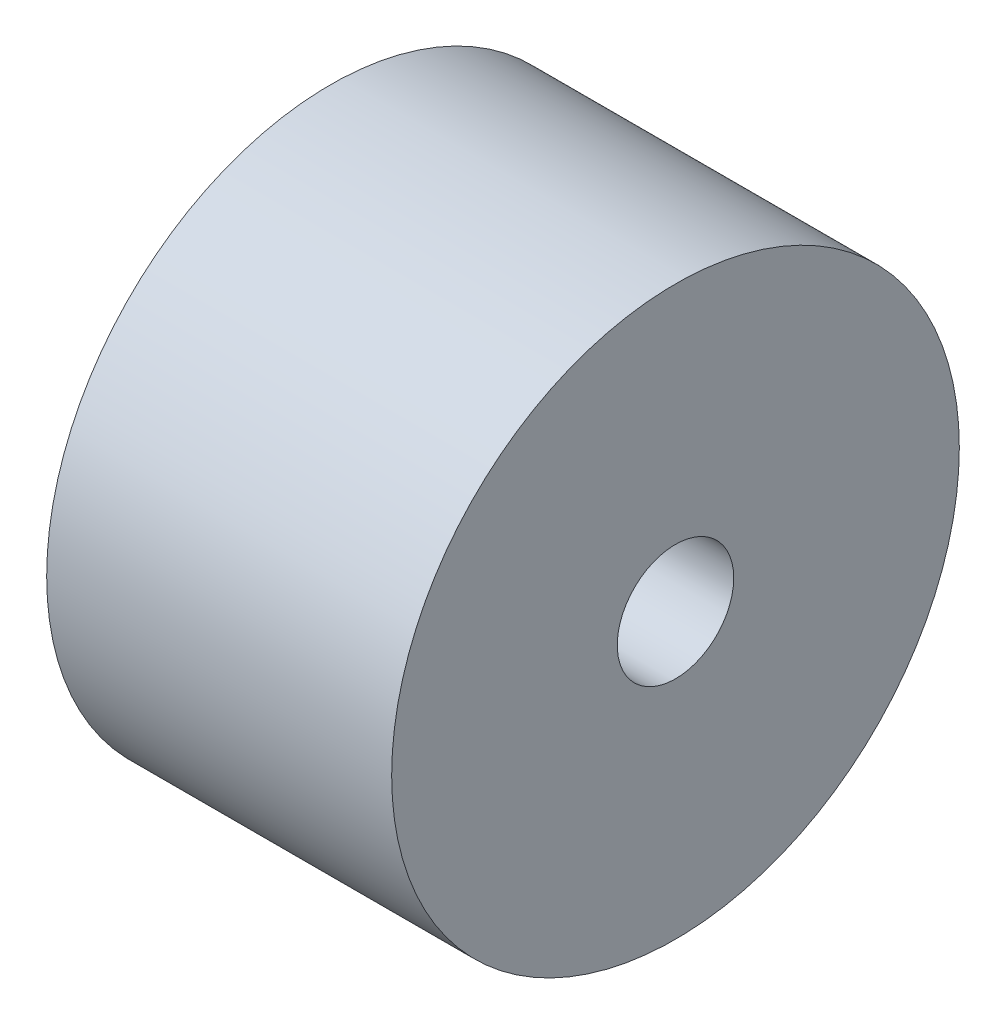
ISO-10303-21;
HEADER;
FILE_DESCRIPTION(('STEP AP214'),'2;1');
FILE_NAME('part.step','',(''),(''),'','','');
FILE_SCHEMA(('AUTOMOTIVE_DESIGN { 1 0 10303 214 1 1 1 1 }'));
ENDSEC;
DATA;
#1=APPLICATION_CONTEXT('core data for automotive mechanical design processes');
#2=APPLICATION_PROTOCOL_DEFINITION('international standard','automotive_design',2000,#1);
#3=PRODUCT_CONTEXT('',#1,'mechanical');
#4=PRODUCT('Part','Part','',(#3));
#5=PRODUCT_RELATED_PRODUCT_CATEGORY('part','',(#4));
#6=PRODUCT_DEFINITION_FORMATION('','',#4);
#7=PRODUCT_DEFINITION_CONTEXT('part definition',#1,'design');
#8=PRODUCT_DEFINITION('design','',#6,#7);
#9=PRODUCT_DEFINITION_SHAPE('','',#8);
#10=(LENGTH_UNIT() NAMED_UNIT(*) SI_UNIT(.MILLI.,.METRE.));
#11=(NAMED_UNIT(*) PLANE_ANGLE_UNIT() SI_UNIT($,.RADIAN.));
#12=(NAMED_UNIT(*) SI_UNIT($,.STERADIAN.) SOLID_ANGLE_UNIT());
#13=UNCERTAINTY_MEASURE_WITH_UNIT(LENGTH_MEASURE(1.E-05),#10,'distance_accuracy_value','');
#14=(GEOMETRIC_REPRESENTATION_CONTEXT(3) GLOBAL_UNCERTAINTY_ASSIGNED_CONTEXT((#13)) GLOBAL_UNIT_ASSIGNED_CONTEXT((#10,
#11,#12)) REPRESENTATION_CONTEXT('',''));
#15=CARTESIAN_POINT('',(0.,0.,0.));
#16=DIRECTION('',(0.,0.,1.));
#17=DIRECTION('',(1.,0.,0.));
#18=AXIS2_PLACEMENT_3D('',#15,#16,#17);
#19=CARTESIAN_POINT('',(8.255,0.,0.));
#20=DIRECTION('',(1.,0.,0.));
#21=DIRECTION('',(0.,0.,-1.));
#22=AXIS2_PLACEMENT_3D('',#19,#20,#21);
#23=PLANE('',#22);
#24=CARTESIAN_POINT('',(8.255,0.,0.));
#25=DIRECTION('',(-1.,0.,0.));
#26=DIRECTION('',(0.,-1.,0.));
#27=AXIS2_PLACEMENT_3D('',#24,#25,#26);
#28=CIRCLE('',#27,3.71375);
#29=CARTESIAN_POINT('',(8.255,-3.71375,0.));
#30=VERTEX_POINT('',#29);
#31=EDGE_CURVE('E46',#30,#30,#28,.T.);
#32=ORIENTED_EDGE('',*,*,#31,.F.);
#33=EDGE_LOOP('',(#32));
#34=FACE_BOUND('',#33,.T.);
#35=CARTESIAN_POINT('',(8.255,0.,0.));
#36=DIRECTION('',(-1.,0.,0.));
#37=DIRECTION('',(0.,0.,1.));
#38=AXIS2_PLACEMENT_3D('',#35,#36,#37);
#39=CIRCLE('',#38,18.1);
#40=CARTESIAN_POINT('',(8.255,0.,18.1));
#41=VERTEX_POINT('',#40);
#42=EDGE_CURVE('E10',#41,#41,#39,.T.);
#43=ORIENTED_EDGE('',*,*,#42,.T.);
#44=EDGE_LOOP('',(#43));
#45=FACE_BOUND('',#44,.T.);
#46=ADVANCED_FACE('F32',(#34,#45),#23,.F.);
#47=CARTESIAN_POINT('',(8.255,0.,0.));
#48=DIRECTION('',(-1.,0.,0.));
#49=DIRECTION('',(0.,0.,1.));
#50=AXIS2_PLACEMENT_3D('',#47,#48,#49);
#51=CYLINDRICAL_SURFACE('',#50,18.1);
#52=ORIENTED_EDGE('',*,*,#42,.F.);
#53=EDGE_LOOP('',(#52));
#54=FACE_BOUND('',#53,.T.);
#55=CARTESIAN_POINT('',(30.255,0.,0.));
#56=DIRECTION('',(-1.,0.,0.));
#57=DIRECTION('',(0.,0.,1.));
#58=AXIS2_PLACEMENT_3D('',#55,#56,#57);
#59=CIRCLE('',#58,18.1);
#60=CARTESIAN_POINT('',(30.255,0.,18.1));
#61=VERTEX_POINT('',#60);
#62=EDGE_CURVE('E38',#61,#61,#59,.T.);
#63=ORIENTED_EDGE('',*,*,#62,.T.);
#64=EDGE_LOOP('',(#63));
#65=FACE_BOUND('',#64,.T.);
#66=ADVANCED_FACE('F71',(#54,#65),#51,.T.);
#67=CARTESIAN_POINT('',(30.255,18.1,0.));
#68=DIRECTION('',(-1.,0.,0.));
#69=DIRECTION('',(0.,0.,1.));
#70=AXIS2_PLACEMENT_3D('',#67,#68,#69);
#71=PLANE('',#70);
#72=CARTESIAN_POINT('',(30.255,0.,0.));
#73=DIRECTION('',(1.,0.,0.));
#74=DIRECTION('',(0.,0.,-1.));
#75=AXIS2_PLACEMENT_3D('',#72,#73,#74);
#76=CIRCLE('',#75,3.71375);
#77=CARTESIAN_POINT('',(30.255,0.,-3.71375));
#78=VERTEX_POINT('',#77);
#79=EDGE_CURVE('E52',#78,#78,#76,.T.);
#80=ORIENTED_EDGE('',*,*,#79,.F.);
#81=EDGE_LOOP('',(#80));
#82=FACE_BOUND('',#81,.T.);
#83=ORIENTED_EDGE('',*,*,#62,.F.);
#84=EDGE_LOOP('',(#83));
#85=FACE_BOUND('',#84,.T.);
#86=ADVANCED_FACE('F67',(#82,#85),#71,.F.);
#87=CARTESIAN_POINT('',(16.8275,0.,0.));
#88=DIRECTION('',(-1.,0.,0.));
#89=DIRECTION('',(0.,-1.,0.));
#90=AXIS2_PLACEMENT_3D('',#87,#88,#89);
#91=CYLINDRICAL_SURFACE('',#90,3.71375);
#92=CARTESIAN_POINT('',(16.8275,0.,0.));
#93=DIRECTION('',(-1.,0.,0.));
#94=DIRECTION('',(0.,-1.,0.));
#95=AXIS2_PLACEMENT_3D('',#92,#93,#94);
#96=CIRCLE('',#95,3.71375);
#97=CARTESIAN_POINT('',(16.8275,-3.71374999999999,0.));
#98=VERTEX_POINT('',#97);
#99=EDGE_CURVE('E42',#98,#98,#96,.T.);
#100=ORIENTED_EDGE('',*,*,#99,.F.);
#101=EDGE_LOOP('',(#100));
#102=FACE_BOUND('',#101,.T.);
#103=ORIENTED_EDGE('',*,*,#31,.T.);
#104=EDGE_LOOP('',(#103));
#105=FACE_BOUND('',#104,.T.);
#106=ADVANCED_FACE('F70',(#102,#105),#91,.F.);
#107=CARTESIAN_POINT('',(16.8275,0.,0.));
#108=DIRECTION('',(-1.,0.,0.));
#109=DIRECTION('',(0.,-1.,0.));
#110=AXIS2_PLACEMENT_3D('',#107,#108,#109);
#111=PLANE('',#110);
#112=ORIENTED_EDGE('',*,*,#99,.T.);
#113=EDGE_LOOP('',(#112));
#114=FACE_BOUND('',#113,.T.);
#115=ADVANCED_FACE('F63',(#114),#111,.T.);
#116=CARTESIAN_POINT('',(21.6825,0.,0.));
#117=DIRECTION('',(1.,0.,0.));
#118=DIRECTION('',(0.,0.,-1.));
#119=AXIS2_PLACEMENT_3D('',#116,#117,#118);
#120=CYLINDRICAL_SURFACE('',#119,3.71375);
#121=CARTESIAN_POINT('',(21.6825,0.,0.));
#122=DIRECTION('',(1.,0.,0.));
#123=DIRECTION('',(0.,0.,-1.));
#124=AXIS2_PLACEMENT_3D('',#121,#122,#123);
#125=CIRCLE('',#124,3.71375);
#126=CARTESIAN_POINT('',(21.6825,0.,-3.71375));
#127=VERTEX_POINT('',#126);
#128=EDGE_CURVE('E50',#127,#127,#125,.T.);
#129=ORIENTED_EDGE('',*,*,#128,.F.);
#130=EDGE_LOOP('',(#129));
#131=FACE_BOUND('',#130,.T.);
#132=ORIENTED_EDGE('',*,*,#79,.T.);
#133=EDGE_LOOP('',(#132));
#134=FACE_BOUND('',#133,.T.);
#135=ADVANCED_FACE('F60',(#131,#134),#120,.F.);
#136=CARTESIAN_POINT('',(21.6825,0.,0.));
#137=DIRECTION('',(1.,0.,0.));
#138=DIRECTION('',(0.,0.,-1.));
#139=AXIS2_PLACEMENT_3D('',#136,#137,#138);
#140=PLANE('',#139);
#141=ORIENTED_EDGE('',*,*,#128,.T.);
#142=EDGE_LOOP('',(#141));
#143=FACE_BOUND('',#142,.T.);
#144=ADVANCED_FACE('F58',(#143),#140,.T.);
#145=CLOSED_SHELL('',(#46,#66,#86,#106,#115,#135,#144));
#146=MANIFOLD_SOLID_BREP('B2',#145);
#147=ADVANCED_BREP_SHAPE_REPRESENTATION('',(#18,#146),#14);
#148=SHAPE_DEFINITION_REPRESENTATION(#9,#147);
ENDSEC;
END-ISO-10303-21;
